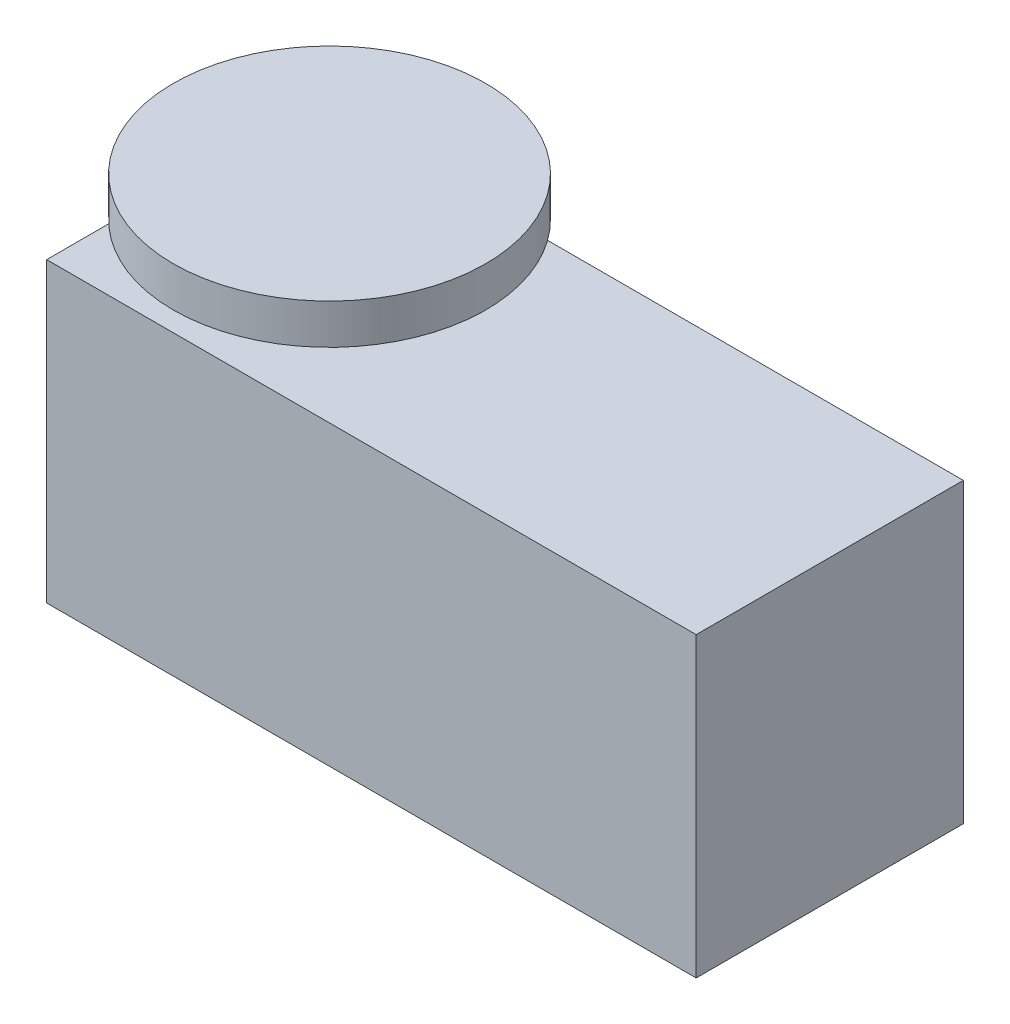
ISO-10303-21;
HEADER;
FILE_DESCRIPTION(('STEP AP214'),'2;1');
FILE_NAME('part.step','',(''),(''),'','','');
FILE_SCHEMA(('AUTOMOTIVE_DESIGN { 1 0 10303 214 1 1 1 1 }'));
ENDSEC;
DATA;
#1=APPLICATION_CONTEXT('core data for automotive mechanical design processes');
#2=APPLICATION_PROTOCOL_DEFINITION('international standard','automotive_design',2000,#1);
#3=PRODUCT_CONTEXT('',#1,'mechanical');
#4=PRODUCT('Part','Part','',(#3));
#5=PRODUCT_RELATED_PRODUCT_CATEGORY('part','',(#4));
#6=PRODUCT_DEFINITION_FORMATION('','',#4);
#7=PRODUCT_DEFINITION_CONTEXT('part definition',#1,'design');
#8=PRODUCT_DEFINITION('design','',#6,#7);
#9=PRODUCT_DEFINITION_SHAPE('','',#8);
#10=(LENGTH_UNIT() NAMED_UNIT(*) SI_UNIT(.MILLI.,.METRE.));
#11=(NAMED_UNIT(*) PLANE_ANGLE_UNIT() SI_UNIT($,.RADIAN.));
#12=(NAMED_UNIT(*) SI_UNIT($,.STERADIAN.) SOLID_ANGLE_UNIT());
#13=UNCERTAINTY_MEASURE_WITH_UNIT(LENGTH_MEASURE(1.E-05),#10,'distance_accuracy_value','');
#14=(GEOMETRIC_REPRESENTATION_CONTEXT(3) GLOBAL_UNCERTAINTY_ASSIGNED_CONTEXT((#13)) GLOBAL_UNIT_ASSIGNED_CONTEXT((#10,
#11,#12)) REPRESENTATION_CONTEXT('',''));
#15=CARTESIAN_POINT('',(0.,0.,0.));
#16=DIRECTION('',(0.,0.,1.));
#17=DIRECTION('',(1.,0.,0.));
#18=AXIS2_PLACEMENT_3D('',#15,#16,#17);
#19=CARTESIAN_POINT('',(-24.31,-11.13,20.));
#20=DIRECTION('',(-1.,0.,0.));
#21=DIRECTION('',(0.,0.,1.));
#22=AXIS2_PLACEMENT_3D('',#19,#20,#21);
#23=PLANE('',#22);
#24=DIRECTION('',(0.,1.,0.));
#25=VECTOR('',#24,1.);
#26=CARTESIAN_POINT('',(-24.31,-11.13,0.));
#27=LINE('',#26,#25);
#28=CARTESIAN_POINT('',(-24.31,-11.13,0.));
#29=VERTEX_POINT('',#28);
#30=CARTESIAN_POINT('',(-24.31,11.13,0.));
#31=VERTEX_POINT('',#30);
#32=EDGE_CURVE('E99',#29,#31,#27,.T.);
#33=ORIENTED_EDGE('',*,*,#32,.F.);
#34=DIRECTION('',(0.,0.,-1.));
#35=VECTOR('',#34,1.);
#36=CARTESIAN_POINT('',(-24.31,-11.13,20.));
#37=LINE('',#36,#35);
#38=CARTESIAN_POINT('',(-24.31,-11.13,20.));
#39=VERTEX_POINT('',#38);
#40=EDGE_CURVE('E11',#39,#29,#37,.T.);
#41=ORIENTED_EDGE('',*,*,#40,.F.);
#42=DIRECTION('',(0.,1.,0.));
#43=VECTOR('',#42,1.);
#44=CARTESIAN_POINT('',(-24.31,-11.13,20.));
#45=LINE('',#44,#43);
#46=CARTESIAN_POINT('',(-24.31,11.13,20.));
#47=VERTEX_POINT('',#46);
#48=EDGE_CURVE('E93',#39,#47,#45,.T.);
#49=ORIENTED_EDGE('',*,*,#48,.T.);
#50=DIRECTION('',(0.,0.,-1.));
#51=VECTOR('',#50,1.);
#52=CARTESIAN_POINT('',(-24.31,11.13,20.));
#53=LINE('',#52,#51);
#54=EDGE_CURVE('E36',#47,#31,#53,.T.);
#55=ORIENTED_EDGE('',*,*,#54,.T.);
#56=EDGE_LOOP('',(#33,#41,#49,#55));
#57=FACE_BOUND('',#56,.T.);
#58=ADVANCED_FACE('F33',(#57),#23,.T.);
#59=CARTESIAN_POINT('',(-24.31,-11.13,20.));
#60=DIRECTION('',(0.,1.,0.));
#61=DIRECTION('',(0.,0.,1.));
#62=AXIS2_PLACEMENT_3D('',#59,#60,#61);
#63=PLANE('',#62);
#64=DIRECTION('',(1.,0.,0.));
#65=VECTOR('',#64,1.);
#66=CARTESIAN_POINT('',(-24.31,-11.13,0.));
#67=LINE('',#66,#65);
#68=CARTESIAN_POINT('',(24.31,-11.13,0.));
#69=VERTEX_POINT('',#68);
#70=EDGE_CURVE('E66',#29,#69,#67,.T.);
#71=ORIENTED_EDGE('',*,*,#70,.T.);
#72=DIRECTION('',(0.,0.,-1.));
#73=VECTOR('',#72,1.);
#74=CARTESIAN_POINT('',(24.31,-11.13,20.));
#75=LINE('',#74,#73);
#76=CARTESIAN_POINT('',(24.31,-11.13,20.));
#77=VERTEX_POINT('',#76);
#78=EDGE_CURVE('E42',#77,#69,#75,.T.);
#79=ORIENTED_EDGE('',*,*,#78,.F.);
#80=DIRECTION('',(1.,0.,0.));
#81=VECTOR('',#80,1.);
#82=CARTESIAN_POINT('',(-24.31,-11.13,20.));
#83=LINE('',#82,#81);
#84=EDGE_CURVE('E83',#39,#77,#83,.T.);
#85=ORIENTED_EDGE('',*,*,#84,.F.);
#86=ORIENTED_EDGE('',*,*,#40,.T.);
#87=EDGE_LOOP('',(#71,#79,#85,#86));
#88=FACE_BOUND('',#87,.T.);
#89=ADVANCED_FACE('F110',(#88),#63,.F.);
#90=CARTESIAN_POINT('',(24.31,-11.13,20.));
#91=DIRECTION('',(-1.,0.,0.));
#92=DIRECTION('',(0.,0.,1.));
#93=AXIS2_PLACEMENT_3D('',#90,#91,#92);
#94=PLANE('',#93);
#95=DIRECTION('',(0.,1.,0.));
#96=VECTOR('',#95,1.);
#97=CARTESIAN_POINT('',(24.31,-11.13,0.));
#98=LINE('',#97,#96);
#99=CARTESIAN_POINT('',(24.31,11.13,0.));
#100=VERTEX_POINT('',#99);
#101=EDGE_CURVE('E90',#69,#100,#98,.T.);
#102=ORIENTED_EDGE('',*,*,#101,.T.);
#103=DIRECTION('',(0.,0.,-1.));
#104=VECTOR('',#103,1.);
#105=CARTESIAN_POINT('',(24.31,11.13,20.));
#106=LINE('',#105,#104);
#107=CARTESIAN_POINT('',(24.31,11.13,20.));
#108=VERTEX_POINT('',#107);
#109=EDGE_CURVE('E87',#108,#100,#106,.T.);
#110=ORIENTED_EDGE('',*,*,#109,.F.);
#111=DIRECTION('',(0.,1.,0.));
#112=VECTOR('',#111,1.);
#113=CARTESIAN_POINT('',(24.31,-11.13,20.));
#114=LINE('',#113,#112);
#115=EDGE_CURVE('E78',#77,#108,#114,.T.);
#116=ORIENTED_EDGE('',*,*,#115,.F.);
#117=ORIENTED_EDGE('',*,*,#78,.T.);
#118=EDGE_LOOP('',(#102,#110,#116,#117));
#119=FACE_BOUND('',#118,.T.);
#120=ADVANCED_FACE('F88',(#119),#94,.F.);
#121=CARTESIAN_POINT('',(-24.31,11.13,20.));
#122=DIRECTION('',(0.,1.,0.));
#123=DIRECTION('',(0.,0.,1.));
#124=AXIS2_PLACEMENT_3D('',#121,#122,#123);
#125=PLANE('',#124);
#126=CARTESIAN_POINT('',(-13.7374676580748,11.13,9.39805628115664));
#127=DIRECTION('',(0.,1.,0.));
#128=DIRECTION('',(0.,0.,1.));
#129=AXIS2_PLACEMENT_3D('',#126,#127,#128);
#130=CIRCLE('',#129,1.87683571346042);
#131=CARTESIAN_POINT('',(-13.7374676580748,11.13,11.2748919946171));
#132=VERTEX_POINT('',#131);
#133=EDGE_CURVE('E130',#132,#132,#130,.T.);
#134=ORIENTED_EDGE('',*,*,#133,.F.);
#135=EDGE_LOOP('',(#134));
#136=FACE_BOUND('',#135,.T.);
#137=DIRECTION('',(1.,0.,0.));
#138=VECTOR('',#137,1.);
#139=CARTESIAN_POINT('',(-24.31,11.13,0.));
#140=LINE('',#139,#138);
#141=EDGE_CURVE('E102',#31,#100,#140,.T.);
#142=ORIENTED_EDGE('',*,*,#141,.F.);
#143=ORIENTED_EDGE('',*,*,#54,.F.);
#144=DIRECTION('',(1.,0.,0.));
#145=VECTOR('',#144,1.);
#146=CARTESIAN_POINT('',(-24.31,11.13,20.));
#147=LINE('',#146,#145);
#148=EDGE_CURVE('E82',#47,#108,#147,.T.);
#149=ORIENTED_EDGE('',*,*,#148,.T.);
#150=ORIENTED_EDGE('',*,*,#109,.T.);
#151=EDGE_LOOP('',(#142,#143,#149,#150));
#152=FACE_BOUND('',#151,.T.);
#153=ADVANCED_FACE('F92',(#136,#152),#125,.T.);
#154=CARTESIAN_POINT('',(0.,0.,20.));
#155=DIRECTION('',(0.,0.,-1.));
#156=DIRECTION('',(-1.,0.,0.));
#157=AXIS2_PLACEMENT_3D('',#154,#155,#156);
#158=PLANE('',#157);
#159=ORIENTED_EDGE('',*,*,#48,.F.);
#160=ORIENTED_EDGE('',*,*,#84,.T.);
#161=ORIENTED_EDGE('',*,*,#115,.T.);
#162=ORIENTED_EDGE('',*,*,#148,.F.);
#163=EDGE_LOOP('',(#159,#160,#161,#162));
#164=FACE_BOUND('',#163,.T.);
#165=ADVANCED_FACE('F81',(#164),#158,.F.);
#166=CARTESIAN_POINT('',(0.,0.,0.));
#167=DIRECTION('',(0.,0.,-1.));
#168=DIRECTION('',(-1.,0.,0.));
#169=AXIS2_PLACEMENT_3D('',#166,#167,#168);
#170=PLANE('',#169);
#171=ORIENTED_EDGE('',*,*,#32,.T.);
#172=ORIENTED_EDGE('',*,*,#141,.T.);
#173=ORIENTED_EDGE('',*,*,#101,.F.);
#174=ORIENTED_EDGE('',*,*,#70,.F.);
#175=EDGE_LOOP('',(#171,#172,#173,#174));
#176=FACE_BOUND('',#175,.T.);
#177=ADVANCED_FACE('F108',(#176),#170,.T.);
#178=CARTESIAN_POINT('',(-13.7374676580748,13.6953946940273,9.39805628115664));
#179=DIRECTION('',(0.,-1.,0.));
#180=DIRECTION('',(0.,0.,-1.));
#181=AXIS2_PLACEMENT_3D('',#178,#179,#180);
#182=CYLINDRICAL_SURFACE('',#181,1.87683571346042);
#183=CARTESIAN_POINT('',(-13.7374676580748,13.6953946940273,9.39805628115664));
#184=DIRECTION('',(0.,1.,0.));
#185=DIRECTION('',(0.,0.,1.));
#186=AXIS2_PLACEMENT_3D('',#183,#184,#185);
#187=CIRCLE('',#186,1.87683571346042);
#188=CARTESIAN_POINT('',(-13.7374676580748,13.6953946940273,11.2748919946171));
#189=VERTEX_POINT('',#188);
#190=EDGE_CURVE('E103',#189,#189,#187,.T.);
#191=ORIENTED_EDGE('',*,*,#190,.F.);
#192=EDGE_LOOP('',(#191));
#193=FACE_BOUND('',#192,.T.);
#194=ORIENTED_EDGE('',*,*,#133,.T.);
#195=EDGE_LOOP('',(#194));
#196=FACE_BOUND('',#195,.T.);
#197=ADVANCED_FACE('F157',(#193,#196),#182,.T.);
#198=CARTESIAN_POINT('',(-13.7374676580748,16.6953946940273,9.39805628115664));
#199=DIRECTION('',(0.,-1.,0.));
#200=DIRECTION('',(0.,0.,-1.));
#201=AXIS2_PLACEMENT_3D('',#198,#199,#200);
#202=CYLINDRICAL_SURFACE('',#201,11.6941891356489);
#203=CARTESIAN_POINT('',(-13.7374676580748,16.6953946940273,9.39805628115664));
#204=DIRECTION('',(0.,1.,0.));
#205=DIRECTION('',(0.,0.,1.));
#206=AXIS2_PLACEMENT_3D('',#203,#204,#205);
#207=CIRCLE('',#206,11.6941891356489);
#208=CARTESIAN_POINT('',(-13.7374676580748,16.6953946940273,21.0922454168055));
#209=VERTEX_POINT('',#208);
#210=EDGE_CURVE('E132',#209,#209,#207,.T.);
#211=ORIENTED_EDGE('',*,*,#210,.F.);
#212=EDGE_LOOP('',(#211));
#213=FACE_BOUND('',#212,.T.);
#214=CARTESIAN_POINT('',(-13.7374676580748,13.6953946940273,9.39805628115664));
#215=DIRECTION('',(0.,1.,0.));
#216=DIRECTION('',(0.,0.,1.));
#217=AXIS2_PLACEMENT_3D('',#214,#215,#216);
#218=CIRCLE('',#217,11.6941891356489);
#219=CARTESIAN_POINT('',(-13.7374676580748,13.6953946940273,21.0922454168055));
#220=VERTEX_POINT('',#219);
#221=EDGE_CURVE('E136',#220,#220,#218,.T.);
#222=ORIENTED_EDGE('',*,*,#221,.T.);
#223=EDGE_LOOP('',(#222));
#224=FACE_BOUND('',#223,.T.);
#225=ADVANCED_FACE('F142',(#213,#224),#202,.T.);
#226=CARTESIAN_POINT('',(-13.7374676580748,16.6953946940273,9.39805628115664));
#227=DIRECTION('',(0.,1.,0.));
#228=DIRECTION('',(0.,0.,1.));
#229=AXIS2_PLACEMENT_3D('',#226,#227,#228);
#230=PLANE('',#229);
#231=ORIENTED_EDGE('',*,*,#210,.T.);
#232=EDGE_LOOP('',(#231));
#233=FACE_BOUND('',#232,.T.);
#234=ADVANCED_FACE('F146',(#233),#230,.T.);
#235=CARTESIAN_POINT('',(-13.7374676580748,13.6953946940273,9.39805628115664));
#236=DIRECTION('',(0.,1.,0.));
#237=DIRECTION('',(0.,0.,1.));
#238=AXIS2_PLACEMENT_3D('',#235,#236,#237);
#239=PLANE('',#238);
#240=ORIENTED_EDGE('',*,*,#190,.T.);
#241=EDGE_LOOP('',(#240));
#242=FACE_BOUND('',#241,.T.);
#243=ORIENTED_EDGE('',*,*,#221,.F.);
#244=EDGE_LOOP('',(#243));
#245=FACE_BOUND('',#244,.T.);
#246=ADVANCED_FACE('F144',(#242,#245),#239,.F.);
#247=CLOSED_SHELL('',(#58,#89,#120,#153,#165,#177,#197,#225,#234,#246));
#248=MANIFOLD_SOLID_BREP('B2',#247);
#249=ADVANCED_BREP_SHAPE_REPRESENTATION('',(#18,#248),#14);
#250=SHAPE_DEFINITION_REPRESENTATION(#9,#249);
ENDSEC;
END-ISO-10303-21;
